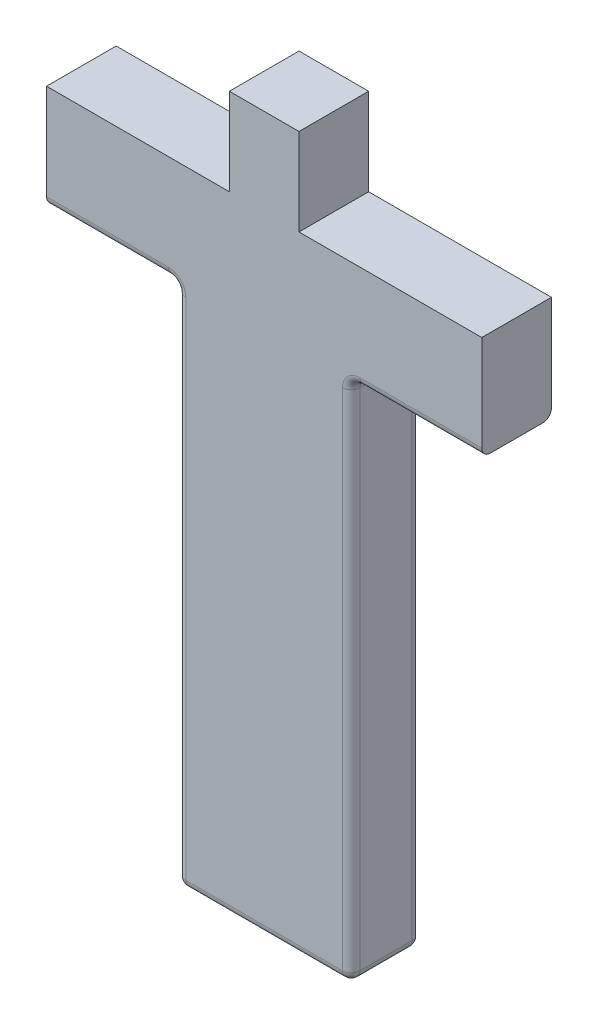
ISO-10303-21;
HEADER;
FILE_DESCRIPTION(('STEP AP214'),'2;1');
FILE_NAME('part.step','',(''),(''),'','','');
FILE_SCHEMA(('AUTOMOTIVE_DESIGN { 1 0 10303 214 1 1 1 1 }'));
ENDSEC;
DATA;
#1=APPLICATION_CONTEXT('core data for automotive mechanical design processes');
#2=APPLICATION_PROTOCOL_DEFINITION('international standard','automotive_design',2000,#1);
#3=PRODUCT_CONTEXT('',#1,'mechanical');
#4=PRODUCT('Part','Part','',(#3));
#5=PRODUCT_RELATED_PRODUCT_CATEGORY('part','',(#4));
#6=PRODUCT_DEFINITION_FORMATION('','',#4);
#7=PRODUCT_DEFINITION_CONTEXT('part definition',#1,'design');
#8=PRODUCT_DEFINITION('design','',#6,#7);
#9=PRODUCT_DEFINITION_SHAPE('','',#8);
#10=(LENGTH_UNIT() NAMED_UNIT(*) SI_UNIT(.MILLI.,.METRE.));
#11=(NAMED_UNIT(*) PLANE_ANGLE_UNIT() SI_UNIT($,.RADIAN.));
#12=(NAMED_UNIT(*) SI_UNIT($,.STERADIAN.) SOLID_ANGLE_UNIT());
#13=UNCERTAINTY_MEASURE_WITH_UNIT(LENGTH_MEASURE(1.E-05),#10,'distance_accuracy_value','');
#14=(GEOMETRIC_REPRESENTATION_CONTEXT(3) GLOBAL_UNCERTAINTY_ASSIGNED_CONTEXT((#13)) GLOBAL_UNIT_ASSIGNED_CONTEXT((#10,
#11,#12)) REPRESENTATION_CONTEXT('',''));
#15=CARTESIAN_POINT('',(0.,0.,0.));
#16=DIRECTION('',(0.,0.,1.));
#17=DIRECTION('',(1.,0.,0.));
#18=AXIS2_PLACEMENT_3D('',#15,#16,#17);
#19=CARTESIAN_POINT('',(0.,0.,8.));
#20=DIRECTION('',(0.,0.,1.));
#21=DIRECTION('',(1.,0.,0.));
#22=AXIS2_PLACEMENT_3D('',#19,#20,#21);
#23=PLANE('',#22);
#24=CARTESIAN_POINT('',(-11.,-7.,8.));
#25=DIRECTION('',(0.,0.,1.));
#26=DIRECTION('',(1.,0.,0.));
#27=AXIS2_PLACEMENT_3D('',#24,#25,#26);
#28=CIRCLE('',#27,2.);
#29=CARTESIAN_POINT('',(-8.99999999999999,-7.,8.));
#30=VERTEX_POINT('',#29);
#31=CARTESIAN_POINT('',(-11.,-5.,8.));
#32=VERTEX_POINT('',#31);
#33=EDGE_CURVE('E368',#30,#32,#28,.T.);
#34=ORIENTED_EDGE('',*,*,#33,.F.);
#35=DIRECTION('',(0.,-1.,0.));
#36=VECTOR('',#35,1.);
#37=CARTESIAN_POINT('',(-8.99999999999999,-66.,8.));
#38=LINE('',#37,#36);
#39=CARTESIAN_POINT('',(-8.99999999999999,-65.,8.));
#40=VERTEX_POINT('',#39);
#41=EDGE_CURVE('E364',#30,#40,#38,.T.);
#42=ORIENTED_EDGE('',*,*,#41,.T.);
#43=DIRECTION('',(1.,0.,0.));
#44=VECTOR('',#43,1.);
#45=CARTESIAN_POINT('',(9.00000000000001,-65.,8.));
#46=LINE('',#45,#44);
#47=CARTESIAN_POINT('',(9.00000000000001,-65.,8.));
#48=VERTEX_POINT('',#47);
#49=EDGE_CURVE('E366',#40,#48,#46,.T.);
#50=ORIENTED_EDGE('',*,*,#49,.T.);
#51=DIRECTION('',(0.,-1.,0.));
#52=VECTOR('',#51,1.);
#53=CARTESIAN_POINT('',(9.00000000000001,0.,8.));
#54=LINE('',#53,#52);
#55=CARTESIAN_POINT('',(9.00000000000001,-7.,8.));
#56=VERTEX_POINT('',#55);
#57=EDGE_CURVE('E304',#48,#56,#54,.F.);
#58=ORIENTED_EDGE('',*,*,#57,.T.);
#59=CARTESIAN_POINT('',(11.,-7.,8.));
#60=DIRECTION('',(0.,0.,1.));
#61=DIRECTION('',(1.,0.,0.));
#62=AXIS2_PLACEMENT_3D('',#59,#60,#61);
#63=CIRCLE('',#62,2.);
#64=CARTESIAN_POINT('',(11.,-5.,8.));
#65=VERTEX_POINT('',#64);
#66=EDGE_CURVE('E301',#65,#56,#63,.T.);
#67=ORIENTED_EDGE('',*,*,#66,.F.);
#68=DIRECTION('',(1.,0.,0.));
#69=VECTOR('',#68,1.);
#70=CARTESIAN_POINT('',(25.,-5.,8.));
#71=LINE('',#70,#69);
#72=CARTESIAN_POINT('',(25.,-5.,8.));
#73=VERTEX_POINT('',#72);
#74=EDGE_CURVE('E299',#65,#73,#71,.T.);
#75=ORIENTED_EDGE('',*,*,#74,.T.);
#76=DIRECTION('',(0.,-1.,0.));
#77=VECTOR('',#76,1.);
#78=CARTESIAN_POINT('',(25.,0.,8.));
#79=LINE('',#78,#77);
#80=CARTESIAN_POINT('',(25.,6.,8.));
#81=VERTEX_POINT('',#80);
#82=EDGE_CURVE('E226',#81,#73,#79,.T.);
#83=ORIENTED_EDGE('',*,*,#82,.F.);
#84=DIRECTION('',(1.,0.,0.));
#85=VECTOR('',#84,1.);
#86=CARTESIAN_POINT('',(0.,6.,8.));
#87=LINE('',#86,#85);
#88=CARTESIAN_POINT('',(4.00000000000001,6.,8.));
#89=VERTEX_POINT('',#88);
#90=EDGE_CURVE('E225',#89,#81,#87,.T.);
#91=ORIENTED_EDGE('',*,*,#90,.F.);
#92=DIRECTION('',(0.,1.,0.));
#93=VECTOR('',#92,1.);
#94=CARTESIAN_POINT('',(4.00000000000001,0.,8.));
#95=LINE('',#94,#93);
#96=CARTESIAN_POINT('',(4.00000000000001,16.,8.));
#97=VERTEX_POINT('',#96);
#98=EDGE_CURVE('E229',#89,#97,#95,.T.);
#99=ORIENTED_EDGE('',*,*,#98,.T.);
#100=DIRECTION('',(1.,0.,0.));
#101=VECTOR('',#100,1.);
#102=CARTESIAN_POINT('',(0.,16.,8.));
#103=LINE('',#102,#101);
#104=CARTESIAN_POINT('',(-3.99999999999999,16.,8.));
#105=VERTEX_POINT('',#104);
#106=EDGE_CURVE('E218',#105,#97,#103,.T.);
#107=ORIENTED_EDGE('',*,*,#106,.F.);
#108=DIRECTION('',(0.,1.,0.));
#109=VECTOR('',#108,1.);
#110=CARTESIAN_POINT('',(-3.99999999999999,0.,8.));
#111=LINE('',#110,#109);
#112=CARTESIAN_POINT('',(-3.99999999999999,6.,8.));
#113=VERTEX_POINT('',#112);
#114=EDGE_CURVE('E202',#113,#105,#111,.T.);
#115=ORIENTED_EDGE('',*,*,#114,.F.);
#116=CARTESIAN_POINT('',(-25.,6.,8.));
#117=VERTEX_POINT('',#116);
#118=EDGE_CURVE('E216',#117,#113,#87,.T.);
#119=ORIENTED_EDGE('',*,*,#118,.F.);
#120=DIRECTION('',(0.,-1.,0.));
#121=VECTOR('',#120,1.);
#122=CARTESIAN_POINT('',(-25.,0.,8.));
#123=LINE('',#122,#121);
#124=CARTESIAN_POINT('',(-25.,-5.,8.));
#125=VERTEX_POINT('',#124);
#126=EDGE_CURVE('E223',#117,#125,#123,.T.);
#127=ORIENTED_EDGE('',*,*,#126,.T.);
#128=DIRECTION('',(1.,0.,0.));
#129=VECTOR('',#128,1.);
#130=CARTESIAN_POINT('',(-9.99999999999999,-5.,8.));
#131=LINE('',#130,#129);
#132=EDGE_CURVE('E210',#125,#32,#131,.T.);
#133=ORIENTED_EDGE('',*,*,#132,.T.);
#134=EDGE_LOOP('',(#34,#42,#50,#58,#67,#75,#83,#91,#99,#107,#115,#119,#127,#133));
#135=FACE_BOUND('',#134,.T.);
#136=ADVANCED_FACE('F36',(#135),#23,.T.);
#137=CARTESIAN_POINT('',(-3.99999999999999,0.,8.));
#138=DIRECTION('',(-1.,0.,0.));
#139=DIRECTION('',(0.,0.,1.));
#140=AXIS2_PLACEMENT_3D('',#137,#138,#139);
#141=PLANE('',#140);
#142=DIRECTION('',(0.,1.,0.));
#143=VECTOR('',#142,1.);
#144=CARTESIAN_POINT('',(-3.99999999999999,0.,0.));
#145=LINE('',#144,#143);
#146=CARTESIAN_POINT('',(-3.99999999999999,6.,0.));
#147=VERTEX_POINT('',#146);
#148=CARTESIAN_POINT('',(-3.99999999999999,16.,0.));
#149=VERTEX_POINT('',#148);
#150=EDGE_CURVE('E205',#147,#149,#145,.T.);
#151=ORIENTED_EDGE('',*,*,#150,.F.);
#152=DIRECTION('',(0.,0.,-1.));
#153=VECTOR('',#152,1.);
#154=CARTESIAN_POINT('',(-3.99999999999999,6.,8.));
#155=LINE('',#154,#153);
#156=EDGE_CURVE('E199',#113,#147,#155,.T.);
#157=ORIENTED_EDGE('',*,*,#156,.F.);
#158=ORIENTED_EDGE('',*,*,#114,.T.);
#159=DIRECTION('',(0.,0.,-1.));
#160=VECTOR('',#159,1.);
#161=CARTESIAN_POINT('',(-3.99999999999999,16.,8.));
#162=LINE('',#161,#160);
#163=EDGE_CURVE('E240',#105,#149,#162,.T.);
#164=ORIENTED_EDGE('',*,*,#163,.T.);
#165=EDGE_LOOP('',(#151,#157,#158,#164));
#166=FACE_BOUND('',#165,.T.);
#167=ADVANCED_FACE('F201',(#166),#141,.T.);
#168=CARTESIAN_POINT('',(0.,6.,8.));
#169=DIRECTION('',(0.,1.,0.));
#170=DIRECTION('',(0.,0.,1.));
#171=AXIS2_PLACEMENT_3D('',#168,#169,#170);
#172=PLANE('',#171);
#173=DIRECTION('',(1.,0.,0.));
#174=VECTOR('',#173,1.);
#175=CARTESIAN_POINT('',(0.,6.,0.));
#176=LINE('',#175,#174);
#177=CARTESIAN_POINT('',(-25.,6.,0.));
#178=VERTEX_POINT('',#177);
#179=EDGE_CURVE('E242',#178,#147,#176,.T.);
#180=ORIENTED_EDGE('',*,*,#179,.F.);
#181=DIRECTION('',(0.,0.,-1.));
#182=VECTOR('',#181,1.);
#183=CARTESIAN_POINT('',(-25.,6.,8.));
#184=LINE('',#183,#182);
#185=EDGE_CURVE('E211',#117,#178,#184,.T.);
#186=ORIENTED_EDGE('',*,*,#185,.F.);
#187=ORIENTED_EDGE('',*,*,#118,.T.);
#188=ORIENTED_EDGE('',*,*,#156,.T.);
#189=EDGE_LOOP('',(#180,#186,#187,#188));
#190=FACE_BOUND('',#189,.T.);
#191=ADVANCED_FACE('F221',(#190),#172,.T.);
#192=CARTESIAN_POINT('',(-25.,0.,8.));
#193=DIRECTION('',(1.,0.,0.));
#194=DIRECTION('',(0.,0.,-1.));
#195=AXIS2_PLACEMENT_3D('',#192,#193,#194);
#196=PLANE('',#195);
#197=DIRECTION('',(0.,-1.,0.));
#198=VECTOR('',#197,1.);
#199=CARTESIAN_POINT('',(-25.,0.,0.));
#200=LINE('',#199,#198);
#201=CARTESIAN_POINT('',(-25.,-5.,0.));
#202=VERTEX_POINT('',#201);
#203=EDGE_CURVE('E245',#178,#202,#200,.T.);
#204=ORIENTED_EDGE('',*,*,#203,.T.);
#205=CARTESIAN_POINT('',(-25.,-5.,1.));
#206=DIRECTION('',(1.,0.,0.));
#207=DIRECTION('',(0.,0.,-1.));
#208=AXIS2_PLACEMENT_3D('',#205,#206,#207);
#209=CIRCLE('',#208,1.);
#210=CARTESIAN_POINT('',(-25.,-6.,1.));
#211=VERTEX_POINT('',#210);
#212=EDGE_CURVE('E327',#202,#211,#209,.F.);
#213=ORIENTED_EDGE('',*,*,#212,.T.);
#214=DIRECTION('',(0.,0.,-1.));
#215=VECTOR('',#214,1.);
#216=CARTESIAN_POINT('',(-25.,-6.,8.));
#217=LINE('',#216,#215);
#218=CARTESIAN_POINT('',(-25.,-6.,7.));
#219=VERTEX_POINT('',#218);
#220=EDGE_CURVE('E267',#219,#211,#217,.T.);
#221=ORIENTED_EDGE('',*,*,#220,.F.);
#222=CARTESIAN_POINT('',(-25.,-5.,7.));
#223=DIRECTION('',(1.,0.,0.));
#224=DIRECTION('',(0.,0.,-1.));
#225=AXIS2_PLACEMENT_3D('',#222,#223,#224);
#226=CIRCLE('',#225,1.);
#227=EDGE_CURVE('E275',#219,#125,#226,.F.);
#228=ORIENTED_EDGE('',*,*,#227,.T.);
#229=ORIENTED_EDGE('',*,*,#126,.F.);
#230=ORIENTED_EDGE('',*,*,#185,.T.);
#231=EDGE_LOOP('',(#204,#213,#221,#228,#229,#230));
#232=FACE_BOUND('',#231,.T.);
#233=ADVANCED_FACE('F476',(#232),#196,.F.);
#234=CARTESIAN_POINT('',(0.,-6.,8.));
#235=DIRECTION('',(0.,1.,0.));
#236=DIRECTION('',(0.,0.,1.));
#237=AXIS2_PLACEMENT_3D('',#234,#235,#236);
#238=PLANE('',#237);
#239=ORIENTED_EDGE('',*,*,#220,.T.);
#240=DIRECTION('',(1.,0.,0.));
#241=VECTOR('',#240,1.);
#242=CARTESIAN_POINT('',(0.,-6.,1.));
#243=LINE('',#242,#241);
#244=CARTESIAN_POINT('',(-11.,-6.,1.));
#245=VERTEX_POINT('',#244);
#246=EDGE_CURVE('E325',#211,#245,#243,.T.);
#247=ORIENTED_EDGE('',*,*,#246,.T.);
#248=DIRECTION('',(0.,0.,-1.));
#249=VECTOR('',#248,1.);
#250=CARTESIAN_POINT('',(-11.,-6.,7.));
#251=LINE('',#250,#249);
#252=CARTESIAN_POINT('',(-11.,-6.,7.));
#253=VERTEX_POINT('',#252);
#254=EDGE_CURVE('E322',#245,#253,#251,.F.);
#255=ORIENTED_EDGE('',*,*,#254,.T.);
#256=DIRECTION('',(1.,0.,0.));
#257=VECTOR('',#256,1.);
#258=CARTESIAN_POINT('',(-25.,-6.,7.));
#259=LINE('',#258,#257);
#260=EDGE_CURVE('E273',#253,#219,#259,.F.);
#261=ORIENTED_EDGE('',*,*,#260,.T.);
#262=EDGE_LOOP('',(#239,#247,#255,#261));
#263=FACE_BOUND('',#262,.T.);
#264=ADVANCED_FACE('F484',(#263),#238,.F.);
#265=CARTESIAN_POINT('',(-9.99999999999999,0.,8.));
#266=DIRECTION('',(1.,0.,0.));
#267=DIRECTION('',(0.,1.,0.));
#268=AXIS2_PLACEMENT_3D('',#265,#266,#267);
#269=PLANE('',#268);
#270=DIRECTION('',(0.,-1.,0.));
#271=VECTOR('',#270,1.);
#272=CARTESIAN_POINT('',(-9.99999999999999,0.,1.));
#273=LINE('',#272,#271);
#274=CARTESIAN_POINT('',(-9.99999999999999,-7.,1.));
#275=VERTEX_POINT('',#274);
#276=CARTESIAN_POINT('',(-9.99999999999999,-65.,1.));
#277=VERTEX_POINT('',#276);
#278=EDGE_CURVE('E308',#275,#277,#273,.T.);
#279=ORIENTED_EDGE('',*,*,#278,.T.);
#280=DIRECTION('',(0.,0.,-1.));
#281=VECTOR('',#280,1.);
#282=CARTESIAN_POINT('',(-9.99999999999999,-65.,8.));
#283=LINE('',#282,#281);
#284=CARTESIAN_POINT('',(-9.99999999999999,-65.,7.));
#285=VERTEX_POINT('',#284);
#286=EDGE_CURVE('E11',#277,#285,#283,.F.);
#287=ORIENTED_EDGE('',*,*,#286,.T.);
#288=DIRECTION('',(0.,-1.,0.));
#289=VECTOR('',#288,1.);
#290=CARTESIAN_POINT('',(-9.99999999999999,-6.73205080756888,7.));
#291=LINE('',#290,#289);
#292=CARTESIAN_POINT('',(-9.99999999999999,-7.,7.));
#293=VERTEX_POINT('',#292);
#294=EDGE_CURVE('E45',#285,#293,#291,.F.);
#295=ORIENTED_EDGE('',*,*,#294,.T.);
#296=DIRECTION('',(0.,0.,-1.));
#297=VECTOR('',#296,1.);
#298=CARTESIAN_POINT('',(-9.99999999999999,-7.,0.));
#299=LINE('',#298,#297);
#300=EDGE_CURVE('E306',#293,#275,#299,.T.);
#301=ORIENTED_EDGE('',*,*,#300,.T.);
#302=EDGE_LOOP('',(#279,#287,#295,#301));
#303=FACE_BOUND('',#302,.T.);
#304=ADVANCED_FACE('F553',(#303),#269,.F.);
#305=CARTESIAN_POINT('',(0.,-66.,8.));
#306=DIRECTION('',(0.,1.,0.));
#307=DIRECTION('',(0.,0.,1.));
#308=AXIS2_PLACEMENT_3D('',#305,#306,#307);
#309=PLANE('',#308);
#310=DIRECTION('',(1.,0.,0.));
#311=VECTOR('',#310,1.);
#312=CARTESIAN_POINT('',(0.,-66.,1.));
#313=LINE('',#312,#311);
#314=CARTESIAN_POINT('',(-8.99999999999999,-66.,1.));
#315=VERTEX_POINT('',#314);
#316=CARTESIAN_POINT('',(9.00000000000001,-66.,1.));
#317=VERTEX_POINT('',#316);
#318=EDGE_CURVE('E59',#315,#317,#313,.T.);
#319=ORIENTED_EDGE('',*,*,#318,.T.);
#320=DIRECTION('',(0.,0.,-1.));
#321=VECTOR('',#320,1.);
#322=CARTESIAN_POINT('',(9.00000000000001,-66.,7.));
#323=LINE('',#322,#321);
#324=CARTESIAN_POINT('',(9.00000000000001,-66.,7.));
#325=VERTEX_POINT('',#324);
#326=EDGE_CURVE('E378',#317,#325,#323,.F.);
#327=ORIENTED_EDGE('',*,*,#326,.T.);
#328=DIRECTION('',(1.,0.,0.));
#329=VECTOR('',#328,1.);
#330=CARTESIAN_POINT('',(-9.99999999999999,-66.,7.));
#331=LINE('',#330,#329);
#332=CARTESIAN_POINT('',(-8.99999999999999,-66.,7.));
#333=VERTEX_POINT('',#332);
#334=EDGE_CURVE('E373',#325,#333,#331,.F.);
#335=ORIENTED_EDGE('',*,*,#334,.T.);
#336=DIRECTION('',(0.,0.,-1.));
#337=VECTOR('',#336,1.);
#338=CARTESIAN_POINT('',(-8.99999999999999,-66.,8.));
#339=LINE('',#338,#337);
#340=EDGE_CURVE('E375',#333,#315,#339,.T.);
#341=ORIENTED_EDGE('',*,*,#340,.T.);
#342=EDGE_LOOP('',(#319,#327,#335,#341));
#343=FACE_BOUND('',#342,.T.);
#344=ADVANCED_FACE('F513',(#343),#309,.F.);
#345=CARTESIAN_POINT('',(10.,0.,8.));
#346=DIRECTION('',(1.,0.,0.));
#347=DIRECTION('',(0.,1.,0.));
#348=AXIS2_PLACEMENT_3D('',#345,#346,#347);
#349=PLANE('',#348);
#350=DIRECTION('',(0.,-1.,0.));
#351=VECTOR('',#350,1.);
#352=CARTESIAN_POINT('',(10.,0.,7.));
#353=LINE('',#352,#351);
#354=CARTESIAN_POINT('',(10.,-7.,7.));
#355=VERTEX_POINT('',#354);
#356=CARTESIAN_POINT('',(10.,-65.,7.));
#357=VERTEX_POINT('',#356);
#358=EDGE_CURVE('E294',#355,#357,#353,.T.);
#359=ORIENTED_EDGE('',*,*,#358,.T.);
#360=DIRECTION('',(0.,0.,-1.));
#361=VECTOR('',#360,1.);
#362=CARTESIAN_POINT('',(10.,-65.,1.));
#363=LINE('',#362,#361);
#364=CARTESIAN_POINT('',(10.,-65.,1.));
#365=VERTEX_POINT('',#364);
#366=EDGE_CURVE('E371',#357,#365,#363,.T.);
#367=ORIENTED_EDGE('',*,*,#366,.T.);
#368=DIRECTION('',(0.,-1.,0.));
#369=VECTOR('',#368,1.);
#370=CARTESIAN_POINT('',(10.,-6.,1.));
#371=LINE('',#370,#369);
#372=CARTESIAN_POINT('',(10.,-7.,1.));
#373=VERTEX_POINT('',#372);
#374=EDGE_CURVE('E297',#365,#373,#371,.F.);
#375=ORIENTED_EDGE('',*,*,#374,.T.);
#376=DIRECTION('',(0.,0.,-1.));
#377=VECTOR('',#376,1.);
#378=CARTESIAN_POINT('',(10.,-7.,8.));
#379=LINE('',#378,#377);
#380=EDGE_CURVE('E292',#373,#355,#379,.F.);
#381=ORIENTED_EDGE('',*,*,#380,.T.);
#382=EDGE_LOOP('',(#359,#367,#375,#381));
#383=FACE_BOUND('',#382,.T.);
#384=ADVANCED_FACE('F439',(#383),#349,.T.);
#385=DIRECTION('',(0.,0.,-1.));
#386=VECTOR('',#385,1.);
#387=CARTESIAN_POINT('',(11.,-6.,8.));
#388=LINE('',#387,#386);
#389=CARTESIAN_POINT('',(11.,-6.,7.));
#390=VERTEX_POINT('',#389);
#391=CARTESIAN_POINT('',(11.,-6.,1.));
#392=VERTEX_POINT('',#391);
#393=EDGE_CURVE('E312',#390,#392,#388,.T.);
#394=ORIENTED_EDGE('',*,*,#393,.T.);
#395=DIRECTION('',(1.,0.,0.));
#396=VECTOR('',#395,1.);
#397=CARTESIAN_POINT('',(0.,-6.,1.));
#398=LINE('',#397,#396);
#399=CARTESIAN_POINT('',(25.,-6.,1.));
#400=VERTEX_POINT('',#399);
#401=EDGE_CURVE('E316',#392,#400,#398,.T.);
#402=ORIENTED_EDGE('',*,*,#401,.T.);
#403=DIRECTION('',(0.,0.,-1.));
#404=VECTOR('',#403,1.);
#405=CARTESIAN_POINT('',(25.,-6.,8.));
#406=LINE('',#405,#404);
#407=CARTESIAN_POINT('',(25.,-6.,7.));
#408=VERTEX_POINT('',#407);
#409=EDGE_CURVE('E264',#408,#400,#406,.T.);
#410=ORIENTED_EDGE('',*,*,#409,.F.);
#411=DIRECTION('',(1.,0.,0.));
#412=VECTOR('',#411,1.);
#413=CARTESIAN_POINT('',(10.,-6.,7.));
#414=LINE('',#413,#412);
#415=EDGE_CURVE('E314',#408,#390,#414,.F.);
#416=ORIENTED_EDGE('',*,*,#415,.T.);
#417=EDGE_LOOP('',(#394,#402,#410,#416));
#418=FACE_BOUND('',#417,.T.);
#419=ADVANCED_FACE('F456',(#418),#238,.F.);
#420=CARTESIAN_POINT('',(25.,0.,8.));
#421=DIRECTION('',(1.,0.,0.));
#422=DIRECTION('',(0.,0.,-1.));
#423=AXIS2_PLACEMENT_3D('',#420,#421,#422);
#424=PLANE('',#423);
#425=ORIENTED_EDGE('',*,*,#409,.T.);
#426=CARTESIAN_POINT('',(25.,-5.,1.));
#427=DIRECTION('',(1.,0.,0.));
#428=DIRECTION('',(0.,0.,-1.));
#429=AXIS2_PLACEMENT_3D('',#426,#427,#428);
#430=CIRCLE('',#429,1.);
#431=CARTESIAN_POINT('',(25.,-5.,0.));
#432=VERTEX_POINT('',#431);
#433=EDGE_CURVE('E320',#400,#432,#430,.T.);
#434=ORIENTED_EDGE('',*,*,#433,.T.);
#435=DIRECTION('',(0.,-1.,0.));
#436=VECTOR('',#435,1.);
#437=CARTESIAN_POINT('',(25.,0.,0.));
#438=LINE('',#437,#436);
#439=CARTESIAN_POINT('',(25.,6.,0.));
#440=VERTEX_POINT('',#439);
#441=EDGE_CURVE('E249',#440,#432,#438,.T.);
#442=ORIENTED_EDGE('',*,*,#441,.F.);
#443=DIRECTION('',(0.,0.,-1.));
#444=VECTOR('',#443,1.);
#445=CARTESIAN_POINT('',(25.,6.,8.));
#446=LINE('',#445,#444);
#447=EDGE_CURVE('E262',#81,#440,#446,.T.);
#448=ORIENTED_EDGE('',*,*,#447,.F.);
#449=ORIENTED_EDGE('',*,*,#82,.T.);
#450=CARTESIAN_POINT('',(25.,-5.,7.));
#451=DIRECTION('',(1.,0.,0.));
#452=DIRECTION('',(0.,0.,-1.));
#453=AXIS2_PLACEMENT_3D('',#450,#451,#452);
#454=CIRCLE('',#453,1.);
#455=EDGE_CURVE('E318',#73,#408,#454,.T.);
#456=ORIENTED_EDGE('',*,*,#455,.T.);
#457=EDGE_LOOP('',(#425,#434,#442,#448,#449,#456));
#458=FACE_BOUND('',#457,.T.);
#459=ADVANCED_FACE('F453',(#458),#424,.T.);
#460=CARTESIAN_POINT('',(4.00000000000001,6.,0.));
#461=VERTEX_POINT('',#460);
#462=EDGE_CURVE('E246',#461,#440,#176,.T.);
#463=ORIENTED_EDGE('',*,*,#462,.F.);
#464=DIRECTION('',(0.,0.,-1.));
#465=VECTOR('',#464,1.);
#466=CARTESIAN_POINT('',(4.00000000000001,6.,8.));
#467=LINE('',#466,#465);
#468=EDGE_CURVE('E260',#89,#461,#467,.T.);
#469=ORIENTED_EDGE('',*,*,#468,.F.);
#470=ORIENTED_EDGE('',*,*,#90,.T.);
#471=ORIENTED_EDGE('',*,*,#447,.T.);
#472=EDGE_LOOP('',(#463,#469,#470,#471));
#473=FACE_BOUND('',#472,.T.);
#474=ADVANCED_FACE('F464',(#473),#172,.T.);
#475=CARTESIAN_POINT('',(4.00000000000001,0.,8.));
#476=DIRECTION('',(-1.,0.,0.));
#477=DIRECTION('',(0.,0.,1.));
#478=AXIS2_PLACEMENT_3D('',#475,#476,#477);
#479=PLANE('',#478);
#480=DIRECTION('',(0.,1.,0.));
#481=VECTOR('',#480,1.);
#482=CARTESIAN_POINT('',(4.00000000000001,0.,0.));
#483=LINE('',#482,#481);
#484=CARTESIAN_POINT('',(4.00000000000001,16.,0.));
#485=VERTEX_POINT('',#484);
#486=EDGE_CURVE('E252',#461,#485,#483,.T.);
#487=ORIENTED_EDGE('',*,*,#486,.T.);
#488=DIRECTION('',(0.,0.,-1.));
#489=VECTOR('',#488,1.);
#490=CARTESIAN_POINT('',(4.00000000000001,16.,8.));
#491=LINE('',#490,#489);
#492=EDGE_CURVE('E258',#97,#485,#491,.T.);
#493=ORIENTED_EDGE('',*,*,#492,.F.);
#494=ORIENTED_EDGE('',*,*,#98,.F.);
#495=ORIENTED_EDGE('',*,*,#468,.T.);
#496=EDGE_LOOP('',(#487,#493,#494,#495));
#497=FACE_BOUND('',#496,.T.);
#498=ADVANCED_FACE('F468',(#497),#479,.F.);
#499=CARTESIAN_POINT('',(0.,16.,8.));
#500=DIRECTION('',(0.,1.,0.));
#501=DIRECTION('',(0.,0.,1.));
#502=AXIS2_PLACEMENT_3D('',#499,#500,#501);
#503=PLANE('',#502);
#504=DIRECTION('',(1.,0.,0.));
#505=VECTOR('',#504,1.);
#506=CARTESIAN_POINT('',(0.,16.,0.));
#507=LINE('',#506,#505);
#508=EDGE_CURVE('E219',#149,#485,#507,.T.);
#509=ORIENTED_EDGE('',*,*,#508,.F.);
#510=ORIENTED_EDGE('',*,*,#163,.F.);
#511=ORIENTED_EDGE('',*,*,#106,.T.);
#512=ORIENTED_EDGE('',*,*,#492,.T.);
#513=EDGE_LOOP('',(#509,#510,#511,#512));
#514=FACE_BOUND('',#513,.T.);
#515=ADVANCED_FACE('F471',(#514),#503,.T.);
#516=CARTESIAN_POINT('',(0.,0.,0.));
#517=DIRECTION('',(0.,0.,1.));
#518=DIRECTION('',(1.,0.,0.));
#519=AXIS2_PLACEMENT_3D('',#516,#517,#518);
#520=PLANE('',#519);
#521=DIRECTION('',(0.,-1.,0.));
#522=VECTOR('',#521,1.);
#523=CARTESIAN_POINT('',(9.00000000000001,-66.,0.));
#524=LINE('',#523,#522);
#525=CARTESIAN_POINT('',(9.00000000000001,-7.,0.));
#526=VERTEX_POINT('',#525);
#527=CARTESIAN_POINT('',(9.00000000000001,-65.,0.));
#528=VERTEX_POINT('',#527);
#529=EDGE_CURVE('E289',#526,#528,#524,.T.);
#530=ORIENTED_EDGE('',*,*,#529,.T.);
#531=DIRECTION('',(1.,0.,0.));
#532=VECTOR('',#531,1.);
#533=CARTESIAN_POINT('',(0.,-65.,0.));
#534=LINE('',#533,#532);
#535=CARTESIAN_POINT('',(-8.99999999999999,-65.,0.));
#536=VERTEX_POINT('',#535);
#537=EDGE_CURVE('E380',#528,#536,#534,.F.);
#538=ORIENTED_EDGE('',*,*,#537,.T.);
#539=DIRECTION('',(0.,-1.,0.));
#540=VECTOR('',#539,1.);
#541=CARTESIAN_POINT('',(-8.99999999999999,0.,0.));
#542=LINE('',#541,#540);
#543=CARTESIAN_POINT('',(-8.99999999999999,-7.,0.));
#544=VERTEX_POINT('',#543);
#545=EDGE_CURVE('E282',#536,#544,#542,.F.);
#546=ORIENTED_EDGE('',*,*,#545,.T.);
#547=CARTESIAN_POINT('',(-11.,-7.,0.));
#548=DIRECTION('',(0.,0.,1.));
#549=DIRECTION('',(1.,0.,0.));
#550=AXIS2_PLACEMENT_3D('',#547,#548,#549);
#551=CIRCLE('',#550,2.);
#552=CARTESIAN_POINT('',(-11.,-5.,0.));
#553=VERTEX_POINT('',#552);
#554=EDGE_CURVE('E279',#553,#544,#551,.F.);
#555=ORIENTED_EDGE('',*,*,#554,.F.);
#556=DIRECTION('',(1.,0.,0.));
#557=VECTOR('',#556,1.);
#558=CARTESIAN_POINT('',(0.,-5.,0.));
#559=LINE('',#558,#557);
#560=EDGE_CURVE('E277',#553,#202,#559,.F.);
#561=ORIENTED_EDGE('',*,*,#560,.T.);
#562=ORIENTED_EDGE('',*,*,#203,.F.);
#563=ORIENTED_EDGE('',*,*,#179,.T.);
#564=ORIENTED_EDGE('',*,*,#150,.T.);
#565=ORIENTED_EDGE('',*,*,#508,.T.);
#566=ORIENTED_EDGE('',*,*,#486,.F.);
#567=ORIENTED_EDGE('',*,*,#462,.T.);
#568=ORIENTED_EDGE('',*,*,#441,.T.);
#569=DIRECTION('',(1.,0.,0.));
#570=VECTOR('',#569,1.);
#571=CARTESIAN_POINT('',(0.,-5.,0.));
#572=LINE('',#571,#570);
#573=CARTESIAN_POINT('',(11.,-5.,0.));
#574=VERTEX_POINT('',#573);
#575=EDGE_CURVE('E287',#432,#574,#572,.F.);
#576=ORIENTED_EDGE('',*,*,#575,.T.);
#577=CARTESIAN_POINT('',(11.,-7.,0.));
#578=DIRECTION('',(0.,0.,1.));
#579=DIRECTION('',(1.,0.,0.));
#580=AXIS2_PLACEMENT_3D('',#577,#578,#579);
#581=CIRCLE('',#580,2.);
#582=EDGE_CURVE('E284',#526,#574,#581,.F.);
#583=ORIENTED_EDGE('',*,*,#582,.F.);
#584=EDGE_LOOP('',(#530,#538,#546,#555,#561,#562,#563,#564,#565,#566,#567,#568,#576,#583));
#585=FACE_BOUND('',#584,.T.);
#586=ADVANCED_FACE('F424',(#585),#520,.F.);
#587=CARTESIAN_POINT('',(0.,-5.,7.));
#588=DIRECTION('',(-1.,0.,0.));
#589=DIRECTION('',(0.,0.,1.));
#590=AXIS2_PLACEMENT_3D('',#587,#588,#589);
#591=CYLINDRICAL_SURFACE('',#590,1.);
#592=ORIENTED_EDGE('',*,*,#260,.F.);
#593=CARTESIAN_POINT('',(-11.,-5.,7.));
#594=DIRECTION('',(1.,0.,0.));
#595=DIRECTION('',(0.,1.,0.));
#596=AXIS2_PLACEMENT_3D('',#593,#594,#595);
#597=CIRCLE('',#596,1.);
#598=EDGE_CURVE('E310',#253,#32,#597,.F.);
#599=ORIENTED_EDGE('',*,*,#598,.T.);
#600=ORIENTED_EDGE('',*,*,#132,.F.);
#601=ORIENTED_EDGE('',*,*,#227,.F.);
#602=EDGE_LOOP('',(#592,#599,#600,#601));
#603=FACE_BOUND('',#602,.T.);
#604=ADVANCED_FACE('F497',(#603),#591,.T.);
#605=CARTESIAN_POINT('',(9.00000000000001,0.,7.));
#606=DIRECTION('',(0.,-1.,0.));
#607=DIRECTION('',(1.,0.,0.));
#608=AXIS2_PLACEMENT_3D('',#605,#606,#607);
#609=CYLINDRICAL_SURFACE('',#608,1.);
#610=ORIENTED_EDGE('',*,*,#57,.F.);
#611=CARTESIAN_POINT('',(9.00000000000001,-65.,7.));
#612=DIRECTION('',(0.,-1.,0.));
#613=DIRECTION('',(1.,0.,0.));
#614=AXIS2_PLACEMENT_3D('',#611,#612,#613);
#615=CIRCLE('',#614,1.);
#616=EDGE_CURVE('E362',#48,#357,#615,.F.);
#617=ORIENTED_EDGE('',*,*,#616,.T.);
#618=ORIENTED_EDGE('',*,*,#358,.F.);
#619=CARTESIAN_POINT('',(9.00000000000001,-7.,7.));
#620=DIRECTION('',(0.,1.,0.));
#621=DIRECTION('',(0.,0.,1.));
#622=AXIS2_PLACEMENT_3D('',#619,#620,#621);
#623=CIRCLE('',#622,1.);
#624=EDGE_CURVE('E243',#56,#355,#623,.T.);
#625=ORIENTED_EDGE('',*,*,#624,.F.);
#626=EDGE_LOOP('',(#610,#617,#618,#625));
#627=FACE_BOUND('',#626,.T.);
#628=ADVANCED_FACE('F443',(#627),#609,.T.);
#629=CARTESIAN_POINT('',(0.,-5.,7.));
#630=DIRECTION('',(-1.,0.,0.));
#631=DIRECTION('',(0.,0.,1.));
#632=AXIS2_PLACEMENT_3D('',#629,#630,#631);
#633=CYLINDRICAL_SURFACE('',#632,1.);
#634=ORIENTED_EDGE('',*,*,#455,.F.);
#635=ORIENTED_EDGE('',*,*,#74,.F.);
#636=CARTESIAN_POINT('',(11.,-5.,7.));
#637=DIRECTION('',(-1.,0.,0.));
#638=DIRECTION('',(0.,0.,1.));
#639=AXIS2_PLACEMENT_3D('',#636,#637,#638);
#640=CIRCLE('',#639,1.);
#641=EDGE_CURVE('E343',#390,#65,#640,.T.);
#642=ORIENTED_EDGE('',*,*,#641,.F.);
#643=ORIENTED_EDGE('',*,*,#415,.F.);
#644=EDGE_LOOP('',(#634,#635,#642,#643));
#645=FACE_BOUND('',#644,.T.);
#646=ADVANCED_FACE('F450',(#645),#633,.T.);
#647=CARTESIAN_POINT('',(11.,-7.,7.));
#648=DIRECTION('',(0.,0.,1.));
#649=DIRECTION('',(1.,0.,0.));
#650=AXIS2_PLACEMENT_3D('',#647,#648,#649);
#651=TOROIDAL_SURFACE('',#650,2.,1.);
#652=ORIENTED_EDGE('',*,*,#66,.T.);
#653=ORIENTED_EDGE('',*,*,#624,.T.);
#654=CARTESIAN_POINT('',(11.,-7.,7.));
#655=DIRECTION('',(0.,0.,1.));
#656=DIRECTION('',(1.,0.,0.));
#657=AXIS2_PLACEMENT_3D('',#654,#655,#656);
#658=CIRCLE('',#657,1.);
#659=EDGE_CURVE('E340',#390,#355,#658,.T.);
#660=ORIENTED_EDGE('',*,*,#659,.F.);
#661=ORIENTED_EDGE('',*,*,#641,.T.);
#662=EDGE_LOOP('',(#652,#653,#660,#661));
#663=FACE_BOUND('',#662,.T.);
#664=ADVANCED_FACE('F446',(#663),#651,.T.);
#665=CARTESIAN_POINT('',(11.,-7.,8.));
#666=DIRECTION('',(0.,0.,-1.));
#667=DIRECTION('',(-1.,0.,0.));
#668=AXIS2_PLACEMENT_3D('',#665,#666,#667);
#669=CYLINDRICAL_SURFACE('',#668,1.);
#670=ORIENTED_EDGE('',*,*,#659,.T.);
#671=ORIENTED_EDGE('',*,*,#380,.F.);
#672=CARTESIAN_POINT('',(11.,-7.,1.));
#673=DIRECTION('',(0.,0.,1.));
#674=DIRECTION('',(1.,0.,0.));
#675=AXIS2_PLACEMENT_3D('',#672,#673,#674);
#676=CIRCLE('',#675,1.);
#677=EDGE_CURVE('E337',#392,#373,#676,.T.);
#678=ORIENTED_EDGE('',*,*,#677,.F.);
#679=ORIENTED_EDGE('',*,*,#393,.F.);
#680=EDGE_LOOP('',(#670,#671,#678,#679));
#681=FACE_BOUND('',#680,.T.);
#682=ADVANCED_FACE('F435',(#681),#669,.F.);
#683=CARTESIAN_POINT('',(0.,-5.,1.));
#684=DIRECTION('',(1.,0.,0.));
#685=DIRECTION('',(0.,0.,-1.));
#686=AXIS2_PLACEMENT_3D('',#683,#684,#685);
#687=CYLINDRICAL_SURFACE('',#686,1.);
#688=ORIENTED_EDGE('',*,*,#433,.F.);
#689=ORIENTED_EDGE('',*,*,#401,.F.);
#690=CARTESIAN_POINT('',(11.,-5.,1.));
#691=DIRECTION('',(-1.,0.,0.));
#692=DIRECTION('',(0.,0.,1.));
#693=AXIS2_PLACEMENT_3D('',#690,#691,#692);
#694=CIRCLE('',#693,1.);
#695=EDGE_CURVE('E333',#574,#392,#694,.T.);
#696=ORIENTED_EDGE('',*,*,#695,.F.);
#697=ORIENTED_EDGE('',*,*,#575,.F.);
#698=EDGE_LOOP('',(#688,#689,#696,#697));
#699=FACE_BOUND('',#698,.T.);
#700=ADVANCED_FACE('F459',(#699),#687,.T.);
#701=CARTESIAN_POINT('',(11.,-7.,1.));
#702=DIRECTION('',(0.,0.,1.));
#703=DIRECTION('',(1.,0.,0.));
#704=AXIS2_PLACEMENT_3D('',#701,#702,#703);
#705=TOROIDAL_SURFACE('',#704,2.,1.);
#706=ORIENTED_EDGE('',*,*,#695,.T.);
#707=ORIENTED_EDGE('',*,*,#677,.T.);
#708=CARTESIAN_POINT('',(9.00000000000001,-7.,1.));
#709=DIRECTION('',(0.,1.,0.));
#710=DIRECTION('',(0.,0.,1.));
#711=AXIS2_PLACEMENT_3D('',#708,#709,#710);
#712=CIRCLE('',#711,1.);
#713=EDGE_CURVE('E330',#526,#373,#712,.F.);
#714=ORIENTED_EDGE('',*,*,#713,.F.);
#715=ORIENTED_EDGE('',*,*,#582,.T.);
#716=EDGE_LOOP('',(#706,#707,#714,#715));
#717=FACE_BOUND('',#716,.T.);
#718=ADVANCED_FACE('F430',(#717),#705,.T.);
#719=CARTESIAN_POINT('',(9.00000000000001,0.,1.));
#720=DIRECTION('',(0.,1.,0.));
#721=DIRECTION('',(-1.,0.,0.));
#722=AXIS2_PLACEMENT_3D('',#719,#720,#721);
#723=CYLINDRICAL_SURFACE('',#722,1.);
#724=ORIENTED_EDGE('',*,*,#374,.F.);
#725=CARTESIAN_POINT('',(9.00000000000001,-65.,1.));
#726=DIRECTION('',(0.,1.,0.));
#727=DIRECTION('',(-1.,0.,0.));
#728=AXIS2_PLACEMENT_3D('',#725,#726,#727);
#729=CIRCLE('',#728,1.);
#730=EDGE_CURVE('E360',#365,#528,#729,.T.);
#731=ORIENTED_EDGE('',*,*,#730,.T.);
#732=ORIENTED_EDGE('',*,*,#529,.F.);
#733=ORIENTED_EDGE('',*,*,#713,.T.);
#734=EDGE_LOOP('',(#724,#731,#732,#733));
#735=FACE_BOUND('',#734,.T.);
#736=ADVANCED_FACE('F422',(#735),#723,.T.);
#737=CARTESIAN_POINT('',(0.,-5.,1.));
#738=DIRECTION('',(1.,0.,0.));
#739=DIRECTION('',(0.,0.,-1.));
#740=AXIS2_PLACEMENT_3D('',#737,#738,#739);
#741=CYLINDRICAL_SURFACE('',#740,1.);
#742=ORIENTED_EDGE('',*,*,#212,.F.);
#743=ORIENTED_EDGE('',*,*,#560,.F.);
#744=CARTESIAN_POINT('',(-11.,-5.,1.));
#745=DIRECTION('',(1.,0.,0.));
#746=DIRECTION('',(0.,0.,-1.));
#747=AXIS2_PLACEMENT_3D('',#744,#745,#746);
#748=CIRCLE('',#747,1.);
#749=EDGE_CURVE('E354',#245,#553,#748,.T.);
#750=ORIENTED_EDGE('',*,*,#749,.F.);
#751=ORIENTED_EDGE('',*,*,#246,.F.);
#752=EDGE_LOOP('',(#742,#743,#750,#751));
#753=FACE_BOUND('',#752,.T.);
#754=ADVANCED_FACE('F480',(#753),#741,.T.);
#755=CARTESIAN_POINT('',(-11.,-7.,8.));
#756=DIRECTION('',(0.,0.,1.));
#757=DIRECTION('',(1.,0.,0.));
#758=AXIS2_PLACEMENT_3D('',#755,#756,#757);
#759=CYLINDRICAL_SURFACE('',#758,1.);
#760=CARTESIAN_POINT('',(-11.,-7.,7.));
#761=DIRECTION('',(0.,0.,1.));
#762=DIRECTION('',(1.,0.,0.));
#763=AXIS2_PLACEMENT_3D('',#760,#761,#762);
#764=CIRCLE('',#763,1.);
#765=EDGE_CURVE('E334',#293,#253,#764,.T.);
#766=ORIENTED_EDGE('',*,*,#765,.T.);
#767=ORIENTED_EDGE('',*,*,#254,.F.);
#768=CARTESIAN_POINT('',(-11.,-7.,1.));
#769=DIRECTION('',(0.,0.,1.));
#770=DIRECTION('',(1.,0.,0.));
#771=AXIS2_PLACEMENT_3D('',#768,#769,#770);
#772=CIRCLE('',#771,1.);
#773=EDGE_CURVE('E351',#275,#245,#772,.T.);
#774=ORIENTED_EDGE('',*,*,#773,.F.);
#775=ORIENTED_EDGE('',*,*,#300,.F.);
#776=EDGE_LOOP('',(#766,#767,#774,#775));
#777=FACE_BOUND('',#776,.T.);
#778=ADVANCED_FACE('F488',(#777),#759,.F.);
#779=CARTESIAN_POINT('',(-11.,-7.,1.));
#780=DIRECTION('',(0.,0.,1.));
#781=DIRECTION('',(1.,0.,0.));
#782=AXIS2_PLACEMENT_3D('',#779,#780,#781);
#783=TOROIDAL_SURFACE('',#782,2.,1.);
#784=ORIENTED_EDGE('',*,*,#749,.T.);
#785=ORIENTED_EDGE('',*,*,#554,.T.);
#786=CARTESIAN_POINT('',(-8.99999999999999,-7.,1.));
#787=DIRECTION('',(0.,1.,0.));
#788=DIRECTION('',(0.,0.,1.));
#789=AXIS2_PLACEMENT_3D('',#786,#787,#788);
#790=CIRCLE('',#789,1.);
#791=EDGE_CURVE('E348',#275,#544,#790,.F.);
#792=ORIENTED_EDGE('',*,*,#791,.F.);
#793=ORIENTED_EDGE('',*,*,#773,.T.);
#794=EDGE_LOOP('',(#784,#785,#792,#793));
#795=FACE_BOUND('',#794,.T.);
#796=ADVANCED_FACE('F577',(#795),#783,.T.);
#797=CARTESIAN_POINT('',(-8.99999999999999,0.,1.));
#798=DIRECTION('',(0.,-1.,0.));
#799=DIRECTION('',(1.,0.,0.));
#800=AXIS2_PLACEMENT_3D('',#797,#798,#799);
#801=CYLINDRICAL_SURFACE('',#800,1.);
#802=ORIENTED_EDGE('',*,*,#545,.F.);
#803=CARTESIAN_POINT('',(-8.99999999999999,-65.,1.));
#804=DIRECTION('',(0.,-1.,0.));
#805=DIRECTION('',(1.,0.,0.));
#806=AXIS2_PLACEMENT_3D('',#803,#804,#805);
#807=CIRCLE('',#806,1.);
#808=EDGE_CURVE('E329',#536,#277,#807,.F.);
#809=ORIENTED_EDGE('',*,*,#808,.T.);
#810=ORIENTED_EDGE('',*,*,#278,.F.);
#811=ORIENTED_EDGE('',*,*,#791,.T.);
#812=EDGE_LOOP('',(#802,#809,#810,#811));
#813=FACE_BOUND('',#812,.T.);
#814=ADVANCED_FACE('F574',(#813),#801,.T.);
#815=CARTESIAN_POINT('',(9.00000000000001,-65.,1.));
#816=DIRECTION('',(0.,1.,0.));
#817=DIRECTION('',(0.,0.,1.));
#818=AXIS2_PLACEMENT_3D('',#815,#816,#817);
#819=SPHERICAL_SURFACE('',#818,1.);
#820=CARTESIAN_POINT('',(9.00000000000001,-65.,1.));
#821=DIRECTION('',(-1.,0.,0.));
#822=DIRECTION('',(0.,0.,1.));
#823=AXIS2_PLACEMENT_3D('',#820,#821,#822);
#824=CIRCLE('',#823,1.);
#825=EDGE_CURVE('E406',#528,#317,#824,.T.);
#826=ORIENTED_EDGE('',*,*,#825,.F.);
#827=ORIENTED_EDGE('',*,*,#730,.F.);
#828=CARTESIAN_POINT('',(9.00000000000001,-65.,1.));
#829=DIRECTION('',(0.,0.,1.));
#830=DIRECTION('',(1.,0.,0.));
#831=AXIS2_PLACEMENT_3D('',#828,#829,#830);
#832=CIRCLE('',#831,1.);
#833=EDGE_CURVE('E40',#317,#365,#832,.T.);
#834=ORIENTED_EDGE('',*,*,#833,.F.);
#835=EDGE_LOOP('',(#826,#827,#834));
#836=FACE_BOUND('',#835,.T.);
#837=ADVANCED_FACE('F38',(#836),#819,.T.);
#838=CARTESIAN_POINT('',(9.00000000000001,-65.,8.));
#839=DIRECTION('',(0.,0.,1.));
#840=DIRECTION('',(1.,0.,0.));
#841=AXIS2_PLACEMENT_3D('',#838,#839,#840);
#842=CYLINDRICAL_SURFACE('',#841,1.);
#843=ORIENTED_EDGE('',*,*,#833,.T.);
#844=ORIENTED_EDGE('',*,*,#366,.F.);
#845=CARTESIAN_POINT('',(9.00000000000001,-65.,7.));
#846=DIRECTION('',(0.,0.,1.));
#847=DIRECTION('',(1.,0.,0.));
#848=AXIS2_PLACEMENT_3D('',#845,#846,#847);
#849=CIRCLE('',#848,1.);
#850=EDGE_CURVE('E404',#325,#357,#849,.T.);
#851=ORIENTED_EDGE('',*,*,#850,.F.);
#852=ORIENTED_EDGE('',*,*,#326,.F.);
#853=EDGE_LOOP('',(#843,#844,#851,#852));
#854=FACE_BOUND('',#853,.T.);
#855=ADVANCED_FACE('F415',(#854),#842,.T.);
#856=CARTESIAN_POINT('',(0.,-65.,1.));
#857=DIRECTION('',(1.,0.,0.));
#858=DIRECTION('',(0.,0.,-1.));
#859=AXIS2_PLACEMENT_3D('',#856,#857,#858);
#860=CYLINDRICAL_SURFACE('',#859,1.);
#861=ORIENTED_EDGE('',*,*,#825,.T.);
#862=ORIENTED_EDGE('',*,*,#318,.F.);
#863=CARTESIAN_POINT('',(-8.99999999999999,-65.,1.));
#864=DIRECTION('',(-1.,0.,0.));
#865=DIRECTION('',(0.,0.,1.));
#866=AXIS2_PLACEMENT_3D('',#863,#864,#865);
#867=CIRCLE('',#866,1.);
#868=EDGE_CURVE('E401',#536,#315,#867,.T.);
#869=ORIENTED_EDGE('',*,*,#868,.F.);
#870=ORIENTED_EDGE('',*,*,#537,.F.);
#871=EDGE_LOOP('',(#861,#862,#869,#870));
#872=FACE_BOUND('',#871,.T.);
#873=ADVANCED_FACE('F522',(#872),#860,.T.);
#874=CARTESIAN_POINT('',(9.00000000000001,-65.,7.));
#875=DIRECTION('',(0.,1.,0.));
#876=DIRECTION('',(0.,0.,1.));
#877=AXIS2_PLACEMENT_3D('',#874,#875,#876);
#878=SPHERICAL_SURFACE('',#877,1.);
#879=ORIENTED_EDGE('',*,*,#850,.T.);
#880=ORIENTED_EDGE('',*,*,#616,.F.);
#881=CARTESIAN_POINT('',(9.00000000000001,-65.,7.));
#882=DIRECTION('',(-1.,0.,0.));
#883=DIRECTION('',(0.,0.,1.));
#884=AXIS2_PLACEMENT_3D('',#881,#882,#883);
#885=CIRCLE('',#884,1.);
#886=EDGE_CURVE('E398',#325,#48,#885,.T.);
#887=ORIENTED_EDGE('',*,*,#886,.F.);
#888=EDGE_LOOP('',(#879,#880,#887));
#889=FACE_BOUND('',#888,.T.);
#890=ADVANCED_FACE('F512',(#889),#878,.T.);
#891=CARTESIAN_POINT('',(-8.99999999999999,-65.,1.));
#892=DIRECTION('',(0.,1.,0.));
#893=DIRECTION('',(0.,0.,1.));
#894=AXIS2_PLACEMENT_3D('',#891,#892,#893);
#895=SPHERICAL_SURFACE('',#894,1.);
#896=ORIENTED_EDGE('',*,*,#808,.F.);
#897=ORIENTED_EDGE('',*,*,#868,.T.);
#898=CARTESIAN_POINT('',(-8.99999999999999,-65.,1.));
#899=DIRECTION('',(0.,0.,1.));
#900=DIRECTION('',(1.,0.,0.));
#901=AXIS2_PLACEMENT_3D('',#898,#899,#900);
#902=CIRCLE('',#901,1.);
#903=EDGE_CURVE('E395',#277,#315,#902,.T.);
#904=ORIENTED_EDGE('',*,*,#903,.F.);
#905=EDGE_LOOP('',(#896,#897,#904));
#906=FACE_BOUND('',#905,.T.);
#907=ADVANCED_FACE('F520',(#906),#895,.T.);
#908=CARTESIAN_POINT('',(0.,-65.,7.));
#909=DIRECTION('',(-1.,0.,0.));
#910=DIRECTION('',(0.,0.,1.));
#911=AXIS2_PLACEMENT_3D('',#908,#909,#910);
#912=CYLINDRICAL_SURFACE('',#911,1.);
#913=ORIENTED_EDGE('',*,*,#886,.T.);
#914=ORIENTED_EDGE('',*,*,#49,.F.);
#915=CARTESIAN_POINT('',(-8.99999999999999,-65.,7.));
#916=DIRECTION('',(-1.,0.,0.));
#917=DIRECTION('',(0.,0.,1.));
#918=AXIS2_PLACEMENT_3D('',#915,#916,#917);
#919=CIRCLE('',#918,1.);
#920=EDGE_CURVE('E392',#333,#40,#919,.T.);
#921=ORIENTED_EDGE('',*,*,#920,.F.);
#922=ORIENTED_EDGE('',*,*,#334,.F.);
#923=EDGE_LOOP('',(#913,#914,#921,#922));
#924=FACE_BOUND('',#923,.T.);
#925=ADVANCED_FACE('F509',(#924),#912,.T.);
#926=CARTESIAN_POINT('',(-8.99999999999999,-65.,8.));
#927=DIRECTION('',(0.,0.,-1.));
#928=DIRECTION('',(-1.,0.,0.));
#929=AXIS2_PLACEMENT_3D('',#926,#927,#928);
#930=CYLINDRICAL_SURFACE('',#929,1.);
#931=ORIENTED_EDGE('',*,*,#903,.T.);
#932=ORIENTED_EDGE('',*,*,#340,.F.);
#933=CARTESIAN_POINT('',(-8.99999999999999,-65.,7.));
#934=DIRECTION('',(0.,0.,1.));
#935=DIRECTION('',(1.,0.,0.));
#936=AXIS2_PLACEMENT_3D('',#933,#934,#935);
#937=CIRCLE('',#936,1.);
#938=EDGE_CURVE('E389',#285,#333,#937,.T.);
#939=ORIENTED_EDGE('',*,*,#938,.F.);
#940=ORIENTED_EDGE('',*,*,#286,.F.);
#941=EDGE_LOOP('',(#931,#932,#939,#940));
#942=FACE_BOUND('',#941,.T.);
#943=ADVANCED_FACE('F516',(#942),#930,.T.);
#944=CARTESIAN_POINT('',(-8.99999999999999,-65.,7.));
#945=DIRECTION('',(0.,0.,1.));
#946=DIRECTION('',(1.,0.,0.));
#947=AXIS2_PLACEMENT_3D('',#944,#945,#946);
#948=SPHERICAL_SURFACE('',#947,1.);
#949=ORIENTED_EDGE('',*,*,#938,.T.);
#950=ORIENTED_EDGE('',*,*,#920,.T.);
#951=CARTESIAN_POINT('',(-8.99999999999999,-65.,7.));
#952=DIRECTION('',(0.,-1.,0.));
#953=DIRECTION('',(0.,0.,-1.));
#954=AXIS2_PLACEMENT_3D('',#951,#952,#953);
#955=CIRCLE('',#954,1.);
#956=EDGE_CURVE('E386',#285,#40,#955,.F.);
#957=ORIENTED_EDGE('',*,*,#956,.F.);
#958=EDGE_LOOP('',(#949,#950,#957));
#959=FACE_BOUND('',#958,.T.);
#960=ADVANCED_FACE('F506',(#959),#948,.T.);
#961=CARTESIAN_POINT('',(-8.99999999999999,0.,7.));
#962=DIRECTION('',(0.,1.,0.));
#963=DIRECTION('',(-1.,0.,0.));
#964=AXIS2_PLACEMENT_3D('',#961,#962,#963);
#965=CYLINDRICAL_SURFACE('',#964,1.);
#966=ORIENTED_EDGE('',*,*,#956,.T.);
#967=ORIENTED_EDGE('',*,*,#41,.F.);
#968=CARTESIAN_POINT('',(-8.99999999999999,-7.,7.));
#969=DIRECTION('',(0.,1.,0.));
#970=DIRECTION('',(0.,0.,1.));
#971=AXIS2_PLACEMENT_3D('',#968,#969,#970);
#972=CIRCLE('',#971,1.);
#973=EDGE_CURVE('E383',#293,#30,#972,.T.);
#974=ORIENTED_EDGE('',*,*,#973,.F.);
#975=ORIENTED_EDGE('',*,*,#294,.F.);
#976=EDGE_LOOP('',(#966,#967,#974,#975));
#977=FACE_BOUND('',#976,.T.);
#978=ADVANCED_FACE('F502',(#977),#965,.T.);
#979=CARTESIAN_POINT('',(-11.,-7.,7.));
#980=DIRECTION('',(0.,0.,1.));
#981=DIRECTION('',(1.,0.,0.));
#982=AXIS2_PLACEMENT_3D('',#979,#980,#981);
#983=TOROIDAL_SURFACE('',#982,2.,1.);
#984=ORIENTED_EDGE('',*,*,#765,.F.);
#985=ORIENTED_EDGE('',*,*,#973,.T.);
#986=ORIENTED_EDGE('',*,*,#33,.T.);
#987=ORIENTED_EDGE('',*,*,#598,.F.);
#988=EDGE_LOOP('',(#984,#985,#986,#987));
#989=FACE_BOUND('',#988,.T.);
#990=ADVANCED_FACE('F494',(#989),#983,.T.);
#991=CLOSED_SHELL('',(#136,#167,#191,#233,#264,#304,#344,#384,#419,#459,#474,#498,#515,#586,
#604,#628,#646,#664,#682,#700,#718,#736,#754,#778,#796,#814,#837,#855,#873,#890,#907,#925,#943,
#960,#978,#990));
#992=MANIFOLD_SOLID_BREP('B2',#991);
#993=ADVANCED_BREP_SHAPE_REPRESENTATION('',(#18,#992),#14);
#994=SHAPE_DEFINITION_REPRESENTATION(#9,#993);
ENDSEC;
END-ISO-10303-21;
